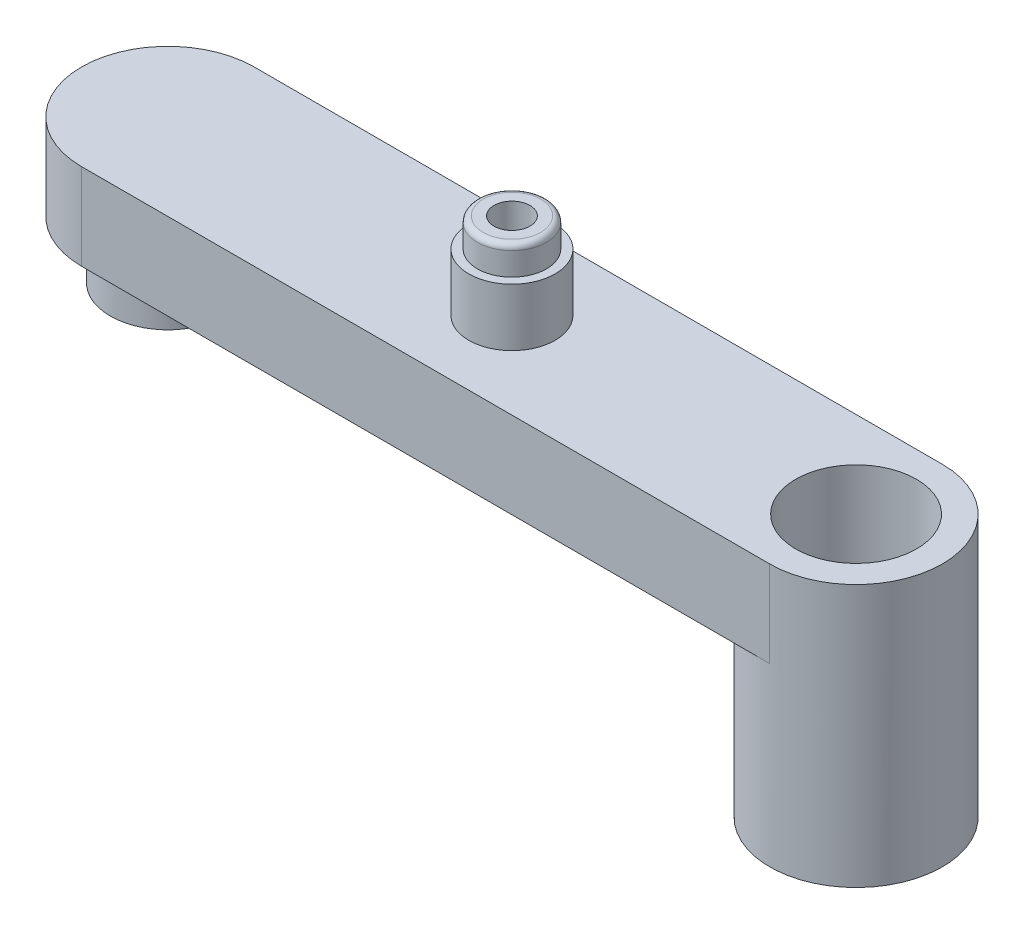
ISO-10303-21;
HEADER;
FILE_DESCRIPTION(('STEP AP214'),'2;1');
FILE_NAME('part.step','',(''),(''),'','','');
FILE_SCHEMA(('AUTOMOTIVE_DESIGN { 1 0 10303 214 1 1 1 1 }'));
ENDSEC;
DATA;
#1=APPLICATION_CONTEXT('core data for automotive mechanical design processes');
#2=APPLICATION_PROTOCOL_DEFINITION('international standard','automotive_design',2000,#1);
#3=PRODUCT_CONTEXT('',#1,'mechanical');
#4=PRODUCT('Part','Part','',(#3));
#5=PRODUCT_RELATED_PRODUCT_CATEGORY('part','',(#4));
#6=PRODUCT_DEFINITION_FORMATION('','',#4);
#7=PRODUCT_DEFINITION_CONTEXT('part definition',#1,'design');
#8=PRODUCT_DEFINITION('design','',#6,#7);
#9=PRODUCT_DEFINITION_SHAPE('','',#8);
#10=(LENGTH_UNIT() NAMED_UNIT(*) SI_UNIT(.MILLI.,.METRE.));
#11=(NAMED_UNIT(*) PLANE_ANGLE_UNIT() SI_UNIT($,.RADIAN.));
#12=(NAMED_UNIT(*) SI_UNIT($,.STERADIAN.) SOLID_ANGLE_UNIT());
#13=UNCERTAINTY_MEASURE_WITH_UNIT(LENGTH_MEASURE(1.E-05),#10,'distance_accuracy_value','');
#14=(GEOMETRIC_REPRESENTATION_CONTEXT(3) GLOBAL_UNCERTAINTY_ASSIGNED_CONTEXT((#13)) GLOBAL_UNIT_ASSIGNED_CONTEXT((#10,
#11,#12)) REPRESENTATION_CONTEXT('',''));
#15=CARTESIAN_POINT('',(0.,0.,0.));
#16=DIRECTION('',(0.,0.,1.));
#17=DIRECTION('',(1.,0.,0.));
#18=AXIS2_PLACEMENT_3D('',#15,#16,#17);
#19=CARTESIAN_POINT('',(-11.96,0.,0.));
#20=DIRECTION('',(0.,1.,0.));
#21=DIRECTION('',(0.,0.,1.));
#22=AXIS2_PLACEMENT_3D('',#19,#20,#21);
#23=PLANE('',#22);
#24=CARTESIAN_POINT('',(-11.96,0.,0.));
#25=DIRECTION('',(0.,1.,0.));
#26=DIRECTION('',(0.,0.,1.));
#27=AXIS2_PLACEMENT_3D('',#24,#25,#26);
#28=CIRCLE('',#27,2.);
#29=CARTESIAN_POINT('',(-11.96,0.,2.));
#30=VERTEX_POINT('',#29);
#31=EDGE_CURVE('E85',#30,#30,#28,.F.);
#32=ORIENTED_EDGE('',*,*,#31,.F.);
#33=EDGE_LOOP('',(#32));
#34=FACE_BOUND('',#33,.T.);
#35=CARTESIAN_POINT('',(11.96,0.,0.));
#36=DIRECTION('',(0.,1.,0.));
#37=DIRECTION('',(0.,0.,1.));
#38=AXIS2_PLACEMENT_3D('',#35,#36,#37);
#39=CIRCLE('',#38,3.);
#40=CARTESIAN_POINT('',(11.96,0.,3.));
#41=VERTEX_POINT('',#40);
#42=CARTESIAN_POINT('',(11.96,0.,-3.));
#43=VERTEX_POINT('',#42);
#44=EDGE_CURVE('E64',#41,#43,#39,.F.);
#45=ORIENTED_EDGE('',*,*,#44,.F.);
#46=DIRECTION('',(1.,0.,0.));
#47=VECTOR('',#46,1.);
#48=CARTESIAN_POINT('',(-11.96,0.,3.));
#49=LINE('',#48,#47);
#50=CARTESIAN_POINT('',(-11.96,0.,3.));
#51=VERTEX_POINT('',#50);
#52=EDGE_CURVE('E83',#51,#41,#49,.T.);
#53=ORIENTED_EDGE('',*,*,#52,.F.);
#54=CARTESIAN_POINT('',(-11.96,0.,0.));
#55=DIRECTION('',(0.,1.,0.));
#56=DIRECTION('',(0.,0.,1.));
#57=AXIS2_PLACEMENT_3D('',#54,#55,#56);
#58=CIRCLE('',#57,3.);
#59=CARTESIAN_POINT('',(-11.96,0.,-3.));
#60=VERTEX_POINT('',#59);
#61=EDGE_CURVE('E93',#60,#51,#58,.T.);
#62=ORIENTED_EDGE('',*,*,#61,.F.);
#63=DIRECTION('',(-1.,0.,0.));
#64=VECTOR('',#63,1.);
#65=CARTESIAN_POINT('',(-11.96,0.,-3.));
#66=LINE('',#65,#64);
#67=EDGE_CURVE('E70',#43,#60,#66,.T.);
#68=ORIENTED_EDGE('',*,*,#67,.F.);
#69=EDGE_LOOP('',(#45,#53,#62,#68));
#70=FACE_BOUND('',#69,.T.);
#71=ADVANCED_FACE('F32',(#34,#70),#23,.F.);
#72=CARTESIAN_POINT('',(-11.96,3.,0.));
#73=DIRECTION('',(0.,-1.,0.));
#74=DIRECTION('',(0.,0.,-1.));
#75=AXIS2_PLACEMENT_3D('',#72,#73,#74);
#76=CYLINDRICAL_SURFACE('',#75,3.);
#77=ORIENTED_EDGE('',*,*,#61,.T.);
#78=DIRECTION('',(0.,-1.,0.));
#79=VECTOR('',#78,1.);
#80=CARTESIAN_POINT('',(-11.96,3.,3.));
#81=LINE('',#80,#79);
#82=CARTESIAN_POINT('',(-11.96,3.,3.));
#83=VERTEX_POINT('',#82);
#84=EDGE_CURVE('E91',#83,#51,#81,.T.);
#85=ORIENTED_EDGE('',*,*,#84,.F.);
#86=CARTESIAN_POINT('',(-11.96,3.,0.));
#87=DIRECTION('',(0.,1.,0.));
#88=DIRECTION('',(0.,0.,1.));
#89=AXIS2_PLACEMENT_3D('',#86,#87,#88);
#90=CIRCLE('',#89,3.);
#91=CARTESIAN_POINT('',(-11.96,3.,-3.));
#92=VERTEX_POINT('',#91);
#93=EDGE_CURVE('E142',#92,#83,#90,.T.);
#94=ORIENTED_EDGE('',*,*,#93,.F.);
#95=DIRECTION('',(0.,-1.,0.));
#96=VECTOR('',#95,1.);
#97=CARTESIAN_POINT('',(-11.96,3.,-3.));
#98=LINE('',#97,#96);
#99=EDGE_CURVE('E101',#92,#60,#98,.T.);
#100=ORIENTED_EDGE('',*,*,#99,.T.);
#101=EDGE_LOOP('',(#77,#85,#94,#100));
#102=FACE_BOUND('',#101,.T.);
#103=ADVANCED_FACE('F150',(#102),#76,.T.);
#104=CARTESIAN_POINT('',(-11.96,3.,3.));
#105=DIRECTION('',(0.,0.,-1.));
#106=DIRECTION('',(-1.,0.,0.));
#107=AXIS2_PLACEMENT_3D('',#104,#105,#106);
#108=PLANE('',#107);
#109=ORIENTED_EDGE('',*,*,#52,.T.);
#110=DIRECTION('',(0.,-1.,0.));
#111=VECTOR('',#110,1.);
#112=CARTESIAN_POINT('',(11.96,3.,3.));
#113=LINE('',#112,#111);
#114=CARTESIAN_POINT('',(11.96,3.,3.));
#115=VERTEX_POINT('',#114);
#116=EDGE_CURVE('E88',#115,#41,#113,.T.);
#117=ORIENTED_EDGE('',*,*,#116,.F.);
#118=DIRECTION('',(1.,0.,0.));
#119=VECTOR('',#118,1.);
#120=CARTESIAN_POINT('',(-11.96,3.,3.));
#121=LINE('',#120,#119);
#122=EDGE_CURVE('E78',#83,#115,#121,.T.);
#123=ORIENTED_EDGE('',*,*,#122,.F.);
#124=ORIENTED_EDGE('',*,*,#84,.T.);
#125=EDGE_LOOP('',(#109,#117,#123,#124));
#126=FACE_BOUND('',#125,.T.);
#127=ADVANCED_FACE('F87',(#126),#108,.F.);
#128=CARTESIAN_POINT('',(11.96,3.,0.));
#129=DIRECTION('',(0.,-1.,0.));
#130=DIRECTION('',(0.,0.,-1.));
#131=AXIS2_PLACEMENT_3D('',#128,#129,#130);
#132=CYLINDRICAL_SURFACE('',#131,3.);
#133=ORIENTED_EDGE('',*,*,#116,.T.);
#134=ORIENTED_EDGE('',*,*,#44,.T.);
#135=DIRECTION('',(0.,-1.,0.));
#136=VECTOR('',#135,1.);
#137=CARTESIAN_POINT('',(11.96,3.,-3.));
#138=LINE('',#137,#136);
#139=CARTESIAN_POINT('',(11.96,3.,-3.));
#140=VERTEX_POINT('',#139);
#141=EDGE_CURVE('E98',#140,#43,#138,.T.);
#142=ORIENTED_EDGE('',*,*,#141,.F.);
#143=CARTESIAN_POINT('',(11.96,3.,0.));
#144=DIRECTION('',(0.,1.,0.));
#145=DIRECTION('',(0.,0.,1.));
#146=AXIS2_PLACEMENT_3D('',#143,#144,#145);
#147=CIRCLE('',#146,3.);
#148=EDGE_CURVE('E97',#115,#140,#147,.T.);
#149=ORIENTED_EDGE('',*,*,#148,.F.);
#150=EDGE_LOOP('',(#133,#134,#142,#149));
#151=FACE_BOUND('',#150,.T.);
#152=CARTESIAN_POINT('',(11.96,-6.12,0.));
#153=DIRECTION('',(0.,-1.,0.));
#154=DIRECTION('',(0.,0.,-1.));
#155=AXIS2_PLACEMENT_3D('',#152,#153,#154);
#156=CIRCLE('',#155,3.);
#157=CARTESIAN_POINT('',(11.96,-6.12,-3.));
#158=VERTEX_POINT('',#157);
#159=EDGE_CURVE('E128',#158,#158,#156,.T.);
#160=ORIENTED_EDGE('',*,*,#159,.F.);
#161=EDGE_LOOP('',(#160));
#162=FACE_BOUND('',#161,.T.);
#163=ADVANCED_FACE('F95',(#151,#162),#132,.T.);
#164=CARTESIAN_POINT('',(-11.96,3.,-3.));
#165=DIRECTION('',(0.,0.,1.));
#166=DIRECTION('',(1.,0.,0.));
#167=AXIS2_PLACEMENT_3D('',#164,#165,#166);
#168=PLANE('',#167);
#169=ORIENTED_EDGE('',*,*,#67,.T.);
#170=ORIENTED_EDGE('',*,*,#99,.F.);
#171=DIRECTION('',(-1.,0.,0.));
#172=VECTOR('',#171,1.);
#173=CARTESIAN_POINT('',(-11.96,3.,-3.));
#174=LINE('',#173,#172);
#175=EDGE_CURVE('E49',#140,#92,#174,.T.);
#176=ORIENTED_EDGE('',*,*,#175,.F.);
#177=ORIENTED_EDGE('',*,*,#141,.T.);
#178=EDGE_LOOP('',(#169,#170,#176,#177));
#179=FACE_BOUND('',#178,.T.);
#180=ADVANCED_FACE('F151',(#179),#168,.F.);
#181=CARTESIAN_POINT('',(-11.96,3.,0.));
#182=DIRECTION('',(0.,1.,0.));
#183=DIRECTION('',(0.,0.,1.));
#184=AXIS2_PLACEMENT_3D('',#181,#182,#183);
#185=PLANE('',#184);
#186=CARTESIAN_POINT('',(0.,3.,0.));
#187=DIRECTION('',(0.,1.,0.));
#188=DIRECTION('',(0.,0.,1.));
#189=AXIS2_PLACEMENT_3D('',#186,#187,#188);
#190=CIRCLE('',#189,1.5);
#191=CARTESIAN_POINT('',(0.,3.,1.5));
#192=VERTEX_POINT('',#191);
#193=EDGE_CURVE('E121',#192,#192,#190,.T.);
#194=ORIENTED_EDGE('',*,*,#193,.F.);
#195=EDGE_LOOP('',(#194));
#196=FACE_BOUND('',#195,.T.);
#197=CARTESIAN_POINT('',(11.96,3.,0.));
#198=DIRECTION('',(0.,-1.,0.));
#199=DIRECTION('',(0.,0.,-1.));
#200=AXIS2_PLACEMENT_3D('',#197,#198,#199);
#201=CIRCLE('',#200,2.1);
#202=CARTESIAN_POINT('',(11.96,3.,-2.1));
#203=VERTEX_POINT('',#202);
#204=EDGE_CURVE('E125',#203,#203,#201,.T.);
#205=ORIENTED_EDGE('',*,*,#204,.T.);
#206=EDGE_LOOP('',(#205));
#207=FACE_BOUND('',#206,.T.);
#208=ORIENTED_EDGE('',*,*,#93,.T.);
#209=ORIENTED_EDGE('',*,*,#122,.T.);
#210=ORIENTED_EDGE('',*,*,#148,.T.);
#211=ORIENTED_EDGE('',*,*,#175,.T.);
#212=EDGE_LOOP('',(#208,#209,#210,#211));
#213=FACE_BOUND('',#212,.T.);
#214=ADVANCED_FACE('F153',(#196,#207,#213),#185,.T.);
#215=CARTESIAN_POINT('',(-11.96,-2.,0.));
#216=DIRECTION('',(0.,1.,0.));
#217=DIRECTION('',(0.,0.,1.));
#218=AXIS2_PLACEMENT_3D('',#215,#216,#217);
#219=CYLINDRICAL_SURFACE('',#218,2.);
#220=CARTESIAN_POINT('',(-11.96,-2.,0.));
#221=DIRECTION('',(0.,-1.,0.));
#222=DIRECTION('',(0.,0.,-1.));
#223=AXIS2_PLACEMENT_3D('',#220,#221,#222);
#224=CIRCLE('',#223,2.);
#225=CARTESIAN_POINT('',(-11.96,-2.,-2.));
#226=VERTEX_POINT('',#225);
#227=EDGE_CURVE('E137',#226,#226,#224,.T.);
#228=ORIENTED_EDGE('',*,*,#227,.F.);
#229=EDGE_LOOP('',(#228));
#230=FACE_BOUND('',#229,.T.);
#231=ORIENTED_EDGE('',*,*,#31,.T.);
#232=EDGE_LOOP('',(#231));
#233=FACE_BOUND('',#232,.T.);
#234=ADVANCED_FACE('F159',(#230,#233),#219,.T.);
#235=CARTESIAN_POINT('',(-11.96,-2.,0.));
#236=DIRECTION('',(0.,-1.,0.));
#237=DIRECTION('',(0.,0.,-1.));
#238=AXIS2_PLACEMENT_3D('',#235,#236,#237);
#239=PLANE('',#238);
#240=CARTESIAN_POINT('',(-11.96,-2.,0.));
#241=DIRECTION('',(0.,-1.,0.));
#242=DIRECTION('',(0.,0.,-1.));
#243=AXIS2_PLACEMENT_3D('',#240,#241,#242);
#244=CIRCLE('',#243,1.1);
#245=CARTESIAN_POINT('',(-11.96,-2.,-1.1));
#246=VERTEX_POINT('',#245);
#247=EDGE_CURVE('E133',#246,#246,#244,.T.);
#248=ORIENTED_EDGE('',*,*,#247,.F.);
#249=EDGE_LOOP('',(#248));
#250=FACE_BOUND('',#249,.T.);
#251=ORIENTED_EDGE('',*,*,#227,.T.);
#252=EDGE_LOOP('',(#251));
#253=FACE_BOUND('',#252,.T.);
#254=ADVANCED_FACE('F173',(#250,#253),#239,.T.);
#255=CARTESIAN_POINT('',(-11.96,1.5,0.));
#256=DIRECTION('',(0.,-1.,0.));
#257=DIRECTION('',(0.,0.,-1.));
#258=AXIS2_PLACEMENT_3D('',#255,#256,#257);
#259=CYLINDRICAL_SURFACE('',#258,1.1);
#260=CARTESIAN_POINT('',(-11.96,1.5,0.));
#261=DIRECTION('',(0.,-1.,0.));
#262=DIRECTION('',(0.,0.,-1.));
#263=AXIS2_PLACEMENT_3D('',#260,#261,#262);
#264=CIRCLE('',#263,1.1);
#265=CARTESIAN_POINT('',(-11.96,1.5,-1.1));
#266=VERTEX_POINT('',#265);
#267=EDGE_CURVE('E134',#266,#266,#264,.T.);
#268=ORIENTED_EDGE('',*,*,#267,.F.);
#269=EDGE_LOOP('',(#268));
#270=FACE_BOUND('',#269,.T.);
#271=ORIENTED_EDGE('',*,*,#247,.T.);
#272=EDGE_LOOP('',(#271));
#273=FACE_BOUND('',#272,.T.);
#274=ADVANCED_FACE('F177',(#270,#273),#259,.F.);
#275=CARTESIAN_POINT('',(-11.96,1.5,0.));
#276=DIRECTION('',(0.,-1.,0.));
#277=DIRECTION('',(0.,0.,-1.));
#278=AXIS2_PLACEMENT_3D('',#275,#276,#277);
#279=PLANE('',#278);
#280=ORIENTED_EDGE('',*,*,#267,.T.);
#281=EDGE_LOOP('',(#280));
#282=FACE_BOUND('',#281,.T.);
#283=ADVANCED_FACE('F181',(#282),#279,.T.);
#284=CARTESIAN_POINT('',(11.96,-6.12,0.));
#285=DIRECTION('',(0.,-1.,0.));
#286=DIRECTION('',(0.,0.,-1.));
#287=AXIS2_PLACEMENT_3D('',#284,#285,#286);
#288=PLANE('',#287);
#289=CARTESIAN_POINT('',(11.96,-6.12,0.));
#290=DIRECTION('',(0.,-1.,0.));
#291=DIRECTION('',(0.,0.,-1.));
#292=AXIS2_PLACEMENT_3D('',#289,#290,#291);
#293=CIRCLE('',#292,2.1);
#294=CARTESIAN_POINT('',(11.96,-6.12,-2.1));
#295=VERTEX_POINT('',#294);
#296=EDGE_CURVE('E120',#295,#295,#293,.T.);
#297=ORIENTED_EDGE('',*,*,#296,.F.);
#298=EDGE_LOOP('',(#297));
#299=FACE_BOUND('',#298,.T.);
#300=ORIENTED_EDGE('',*,*,#159,.T.);
#301=EDGE_LOOP('',(#300));
#302=FACE_BOUND('',#301,.T.);
#303=ADVANCED_FACE('F185',(#299,#302),#288,.T.);
#304=CARTESIAN_POINT('',(11.96,3.,0.));
#305=DIRECTION('',(0.,-1.,0.));
#306=DIRECTION('',(0.,0.,-1.));
#307=AXIS2_PLACEMENT_3D('',#304,#305,#306);
#308=CYLINDRICAL_SURFACE('',#307,2.1);
#309=ORIENTED_EDGE('',*,*,#204,.F.);
#310=EDGE_LOOP('',(#309));
#311=FACE_BOUND('',#310,.T.);
#312=ORIENTED_EDGE('',*,*,#296,.T.);
#313=EDGE_LOOP('',(#312));
#314=FACE_BOUND('',#313,.T.);
#315=ADVANCED_FACE('F189',(#311,#314),#308,.F.);
#316=CARTESIAN_POINT('',(0.,5.,0.));
#317=DIRECTION('',(0.,-1.,0.));
#318=DIRECTION('',(0.,0.,-1.));
#319=AXIS2_PLACEMENT_3D('',#316,#317,#318);
#320=CYLINDRICAL_SURFACE('',#319,1.5);
#321=CARTESIAN_POINT('',(0.,5.,0.));
#322=DIRECTION('',(0.,1.,0.));
#323=DIRECTION('',(0.,0.,1.));
#324=AXIS2_PLACEMENT_3D('',#321,#322,#323);
#325=CIRCLE('',#324,1.5);
#326=CARTESIAN_POINT('',(0.,5.,1.5));
#327=VERTEX_POINT('',#326);
#328=EDGE_CURVE('E117',#327,#327,#325,.T.);
#329=ORIENTED_EDGE('',*,*,#328,.F.);
#330=EDGE_LOOP('',(#329));
#331=FACE_BOUND('',#330,.T.);
#332=ORIENTED_EDGE('',*,*,#193,.T.);
#333=EDGE_LOOP('',(#332));
#334=FACE_BOUND('',#333,.T.);
#335=ADVANCED_FACE('F193',(#331,#334),#320,.T.);
#336=CARTESIAN_POINT('',(0.,5.,0.));
#337=DIRECTION('',(0.,1.,0.));
#338=DIRECTION('',(0.,0.,1.));
#339=AXIS2_PLACEMENT_3D('',#336,#337,#338);
#340=PLANE('',#339);
#341=CARTESIAN_POINT('',(0.,5.,0.));
#342=DIRECTION('',(0.,1.,0.));
#343=DIRECTION('',(0.,0.,1.));
#344=AXIS2_PLACEMENT_3D('',#341,#342,#343);
#345=CIRCLE('',#344,1.2);
#346=CARTESIAN_POINT('',(0.,5.,1.2));
#347=VERTEX_POINT('',#346);
#348=EDGE_CURVE('E84',#347,#347,#345,.T.);
#349=ORIENTED_EDGE('',*,*,#348,.F.);
#350=EDGE_LOOP('',(#349));
#351=FACE_BOUND('',#350,.T.);
#352=ORIENTED_EDGE('',*,*,#328,.T.);
#353=EDGE_LOOP('',(#352));
#354=FACE_BOUND('',#353,.T.);
#355=ADVANCED_FACE('F197',(#351,#354),#340,.T.);
#356=CARTESIAN_POINT('',(0.,6.,0.));
#357=DIRECTION('',(0.,-1.,0.));
#358=DIRECTION('',(0.,0.,-1.));
#359=AXIS2_PLACEMENT_3D('',#356,#357,#358);
#360=CYLINDRICAL_SURFACE('',#359,1.2);
#361=CARTESIAN_POINT('',(0.,5.8,0.));
#362=DIRECTION('',(0.,1.,0.));
#363=DIRECTION('',(0.,0.,1.));
#364=AXIS2_PLACEMENT_3D('',#361,#362,#363);
#365=CIRCLE('',#364,1.2);
#366=CARTESIAN_POINT('',(0.,5.8,1.2));
#367=VERTEX_POINT('',#366);
#368=EDGE_CURVE('E11',#367,#367,#365,.F.);
#369=ORIENTED_EDGE('',*,*,#368,.T.);
#370=EDGE_LOOP('',(#369));
#371=FACE_BOUND('',#370,.T.);
#372=ORIENTED_EDGE('',*,*,#348,.T.);
#373=EDGE_LOOP('',(#372));
#374=FACE_BOUND('',#373,.T.);
#375=ADVANCED_FACE('F201',(#371,#374),#360,.T.);
#376=CARTESIAN_POINT('',(0.,6.,0.));
#377=DIRECTION('',(0.,1.,0.));
#378=DIRECTION('',(0.,0.,1.));
#379=AXIS2_PLACEMENT_3D('',#376,#377,#378);
#380=PLANE('',#379);
#381=CARTESIAN_POINT('',(0.,6.,0.));
#382=DIRECTION('',(0.,1.,0.));
#383=DIRECTION('',(0.,0.,1.));
#384=AXIS2_PLACEMENT_3D('',#381,#382,#383);
#385=CIRCLE('',#384,1.);
#386=CARTESIAN_POINT('',(0.,6.,1.));
#387=VERTEX_POINT('',#386);
#388=EDGE_CURVE('E41',#387,#387,#385,.T.);
#389=ORIENTED_EDGE('',*,*,#388,.T.);
#390=EDGE_LOOP('',(#389));
#391=FACE_BOUND('',#390,.T.);
#392=CARTESIAN_POINT('',(0.,6.,0.));
#393=DIRECTION('',(0.,1.,0.));
#394=DIRECTION('',(0.,0.,1.));
#395=AXIS2_PLACEMENT_3D('',#392,#393,#394);
#396=CIRCLE('',#395,0.625);
#397=CARTESIAN_POINT('',(0.,6.,0.625000000000001));
#398=VERTEX_POINT('',#397);
#399=EDGE_CURVE('E115',#398,#398,#396,.T.);
#400=ORIENTED_EDGE('',*,*,#399,.F.);
#401=EDGE_LOOP('',(#400));
#402=FACE_BOUND('',#401,.T.);
#403=ADVANCED_FACE('F205',(#391,#402),#380,.T.);
#404=CARTESIAN_POINT('',(0.,2.5,0.));
#405=DIRECTION('',(0.,1.,0.));
#406=DIRECTION('',(0.,0.,1.));
#407=AXIS2_PLACEMENT_3D('',#404,#405,#406);
#408=CYLINDRICAL_SURFACE('',#407,0.625);
#409=CARTESIAN_POINT('',(0.,2.5,0.));
#410=DIRECTION('',(0.,1.,0.));
#411=DIRECTION('',(0.,0.,1.));
#412=AXIS2_PLACEMENT_3D('',#409,#410,#411);
#413=CIRCLE('',#412,0.625);
#414=CARTESIAN_POINT('',(0.,2.5,0.625000000000001));
#415=VERTEX_POINT('',#414);
#416=EDGE_CURVE('E124',#415,#415,#413,.T.);
#417=ORIENTED_EDGE('',*,*,#416,.F.);
#418=EDGE_LOOP('',(#417));
#419=FACE_BOUND('',#418,.T.);
#420=ORIENTED_EDGE('',*,*,#399,.T.);
#421=EDGE_LOOP('',(#420));
#422=FACE_BOUND('',#421,.T.);
#423=ADVANCED_FACE('F209',(#419,#422),#408,.F.);
#424=CARTESIAN_POINT('',(0.,2.5,0.));
#425=DIRECTION('',(0.,1.,0.));
#426=DIRECTION('',(0.,0.,1.));
#427=AXIS2_PLACEMENT_3D('',#424,#425,#426);
#428=PLANE('',#427);
#429=ORIENTED_EDGE('',*,*,#416,.T.);
#430=EDGE_LOOP('',(#429));
#431=FACE_BOUND('',#430,.T.);
#432=ADVANCED_FACE('F212',(#431),#428,.T.);
#433=CARTESIAN_POINT('',(0.,5.8,0.));
#434=DIRECTION('',(0.,1.,0.));
#435=DIRECTION('',(0.,0.,1.));
#436=AXIS2_PLACEMENT_3D('',#433,#434,#435);
#437=TOROIDAL_SURFACE('',#436,1.,0.2);
#438=ORIENTED_EDGE('',*,*,#368,.F.);
#439=EDGE_LOOP('',(#438));
#440=FACE_BOUND('',#439,.T.);
#441=ORIENTED_EDGE('',*,*,#388,.F.);
#442=EDGE_LOOP('',(#441));
#443=FACE_BOUND('',#442,.T.);
#444=ADVANCED_FACE('F34',(#440,#443),#437,.T.);
#445=CLOSED_SHELL('',(#71,#103,#127,#163,#180,#214,#234,#254,#274,#283,#303,#315,#335,#355,#375,
#403,#423,#432,#444));
#446=MANIFOLD_SOLID_BREP('B2',#445);
#447=ADVANCED_BREP_SHAPE_REPRESENTATION('',(#18,#446),#14);
#448=SHAPE_DEFINITION_REPRESENTATION(#9,#447);
ENDSEC;
END-ISO-10303-21;
